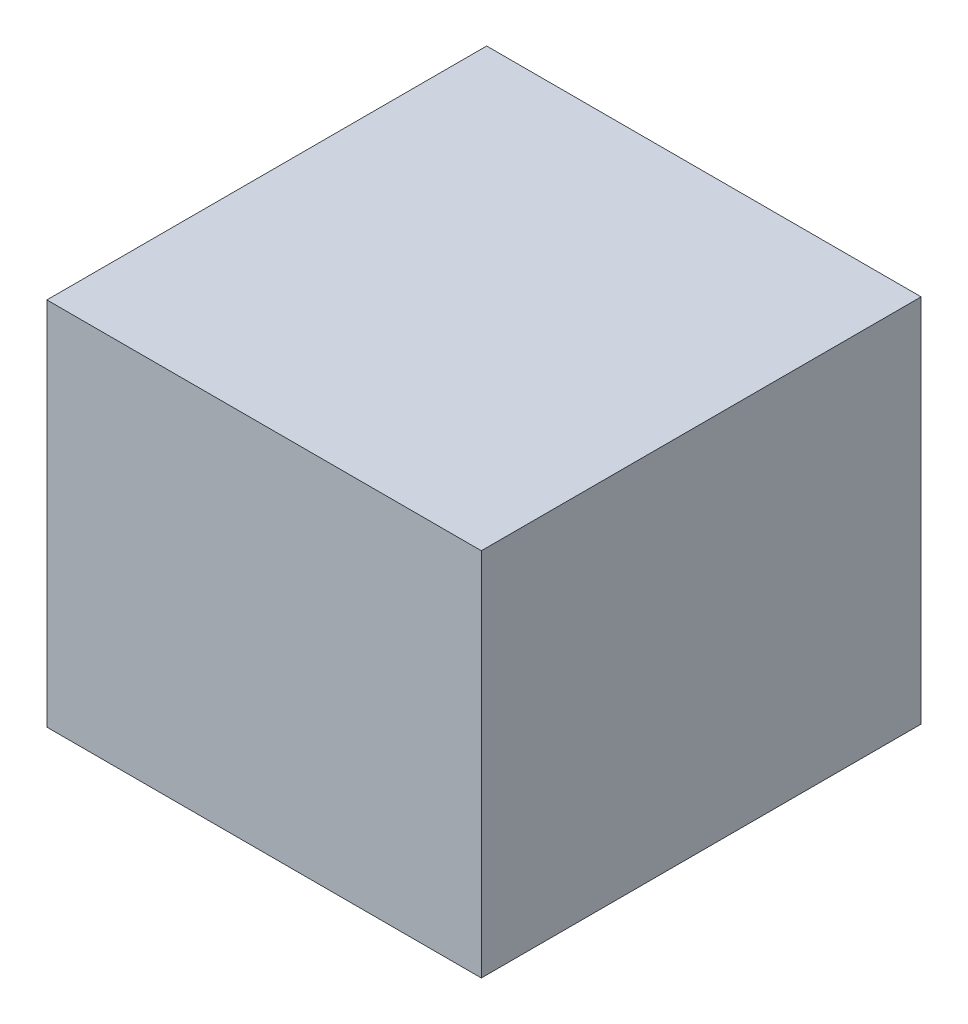
ISO-10303-21;
HEADER;
FILE_DESCRIPTION(('STEP AP214'),'2;1');
FILE_NAME('part.step','',(''),(''),'','','');
FILE_SCHEMA(('AUTOMOTIVE_DESIGN { 1 0 10303 214 1 1 1 1 }'));
ENDSEC;
DATA;
#1=APPLICATION_CONTEXT('core data for automotive mechanical design processes');
#2=APPLICATION_PROTOCOL_DEFINITION('international standard','automotive_design',2000,#1);
#3=PRODUCT_CONTEXT('',#1,'mechanical');
#4=PRODUCT('Part','Part','',(#3));
#5=PRODUCT_RELATED_PRODUCT_CATEGORY('part','',(#4));
#6=PRODUCT_DEFINITION_FORMATION('','',#4);
#7=PRODUCT_DEFINITION_CONTEXT('part definition',#1,'design');
#8=PRODUCT_DEFINITION('design','',#6,#7);
#9=PRODUCT_DEFINITION_SHAPE('','',#8);
#10=(LENGTH_UNIT() NAMED_UNIT(*) SI_UNIT(.MILLI.,.METRE.));
#11=(NAMED_UNIT(*) PLANE_ANGLE_UNIT() SI_UNIT($,.RADIAN.));
#12=(NAMED_UNIT(*) SI_UNIT($,.STERADIAN.) SOLID_ANGLE_UNIT());
#13=UNCERTAINTY_MEASURE_WITH_UNIT(LENGTH_MEASURE(1.E-05),#10,'distance_accuracy_value','');
#14=(GEOMETRIC_REPRESENTATION_CONTEXT(3) GLOBAL_UNCERTAINTY_ASSIGNED_CONTEXT((#13)) GLOBAL_UNIT_ASSIGNED_CONTEXT((#10,
#11,#12)) REPRESENTATION_CONTEXT('',''));
#15=CARTESIAN_POINT('',(0.,0.,0.));
#16=DIRECTION('',(0.,0.,1.));
#17=DIRECTION('',(1.,0.,0.));
#18=AXIS2_PLACEMENT_3D('',#15,#16,#17);
#19=CARTESIAN_POINT('',(0.,1.26999997064E-06,0.5999988));
#20=DIRECTION('',(0.,0.,-1.));
#21=DIRECTION('',(0.,-1.,0.));
#22=AXIS2_PLACEMENT_3D('',#19,#20,#21);
#23=PLANE('',#22);
#24=DIRECTION('',(0.999999999963275,8.57026550148136E-06,0.));
#25=VECTOR('',#24,1.);
#26=CARTESIAN_POINT('',(-0.29637482,0.25240742,0.5999988));
#27=LINE('',#26,#25);
#28=CARTESIAN_POINT('',(-0.29637482,0.25240742,0.5999988));
#29=VERTEX_POINT('',#28);
#30=CARTESIAN_POINT('',(0.29637228,0.2524125,0.5999988));
#31=VERTEX_POINT('',#30);
#32=EDGE_CURVE('E93',#29,#31,#27,.T.);
#33=ORIENTED_EDGE('',*,*,#32,.F.);
#34=DIRECTION('',(-5.03152242608172E-06,0.999999999987342,0.));
#35=VECTOR('',#34,1.);
#36=CARTESIAN_POINT('',(-0.29637228,-0.25240996,0.5999988));
#37=LINE('',#36,#35);
#38=CARTESIAN_POINT('',(-0.29637228,-0.25240996,0.5999988));
#39=VERTEX_POINT('',#38);
#40=EDGE_CURVE('E26',#39,#29,#37,.T.);
#41=ORIENTED_EDGE('',*,*,#40,.F.);
#42=DIRECTION('',(-0.999999999963275,-8.57026554942936E-06,0.));
#43=VECTOR('',#42,1.);
#44=CARTESIAN_POINT('',(0.29637482,-0.25240488,0.5999988));
#45=LINE('',#44,#43);
#46=CARTESIAN_POINT('',(0.29637482,-0.25240488,0.5999988));
#47=VERTEX_POINT('',#46);
#48=EDGE_CURVE('E82',#47,#39,#45,.T.);
#49=ORIENTED_EDGE('',*,*,#48,.F.);
#50=DIRECTION('',(5.03152253868372E-06,-0.999999999987342,0.));
#51=VECTOR('',#50,1.);
#52=CARTESIAN_POINT('',(0.29637228,0.2524125,0.5999988));
#53=LINE('',#52,#51);
#54=EDGE_CURVE('E90',#31,#47,#53,.T.);
#55=ORIENTED_EDGE('',*,*,#54,.F.);
#56=EDGE_LOOP('',(#33,#41,#49,#55));
#57=FACE_BOUND('',#56,.T.);
#58=ADVANCED_FACE('F16',(#57),#23,.F.);
#59=CARTESIAN_POINT('',(0.,1.26999997064E-06,0.));
#60=DIRECTION('',(0.,0.,-1.));
#61=DIRECTION('',(0.,-1.,0.));
#62=AXIS2_PLACEMENT_3D('',#59,#60,#61);
#63=PLANE('',#62);
#64=DIRECTION('',(0.999999999963275,8.57026550148136E-06,0.));
#65=VECTOR('',#64,1.);
#66=CARTESIAN_POINT('',(-0.29637482,0.25240742,0.));
#67=LINE('',#66,#65);
#68=CARTESIAN_POINT('',(-0.29637482,0.25240742,0.));
#69=VERTEX_POINT('',#68);
#70=CARTESIAN_POINT('',(0.29637228,0.2524125,0.));
#71=VERTEX_POINT('',#70);
#72=EDGE_CURVE('E85',#69,#71,#67,.T.);
#73=ORIENTED_EDGE('',*,*,#72,.T.);
#74=DIRECTION('',(5.03152253868372E-06,-0.999999999987342,0.));
#75=VECTOR('',#74,1.);
#76=CARTESIAN_POINT('',(0.29637228,0.2524125,0.));
#77=LINE('',#76,#75);
#78=CARTESIAN_POINT('',(0.29637482,-0.25240488,0.));
#79=VERTEX_POINT('',#78);
#80=EDGE_CURVE('E72',#71,#79,#77,.T.);
#81=ORIENTED_EDGE('',*,*,#80,.T.);
#82=DIRECTION('',(-0.999999999963275,-8.57026554942936E-06,0.));
#83=VECTOR('',#82,1.);
#84=CARTESIAN_POINT('',(0.29637482,-0.25240488,0.));
#85=LINE('',#84,#83);
#86=CARTESIAN_POINT('',(-0.29637228,-0.25240996,0.));
#87=VERTEX_POINT('',#86);
#88=EDGE_CURVE('E20',#79,#87,#85,.T.);
#89=ORIENTED_EDGE('',*,*,#88,.T.);
#90=DIRECTION('',(-5.03152242608172E-06,0.999999999987342,0.));
#91=VECTOR('',#90,1.);
#92=CARTESIAN_POINT('',(-0.29637228,-0.25240996,0.));
#93=LINE('',#92,#91);
#94=EDGE_CURVE('E11',#87,#69,#93,.T.);
#95=ORIENTED_EDGE('',*,*,#94,.T.);
#96=EDGE_LOOP('',(#73,#81,#89,#95));
#97=FACE_BOUND('',#96,.T.);
#98=ADVANCED_FACE('F86',(#97),#63,.T.);
#99=CARTESIAN_POINT('',(-0.29637228,-0.25240996,0.));
#100=DIRECTION('',(-0.999999999987342,-5.03152242608172E-06,0.));
#101=DIRECTION('',(-5.03152242608172E-06,0.999999999987342,0.));
#102=AXIS2_PLACEMENT_3D('',#99,#100,#101);
#103=PLANE('',#102);
#104=DIRECTION('',(0.,0.,1.));
#105=VECTOR('',#104,1.);
#106=CARTESIAN_POINT('',(-0.29637228,-0.25240996,0.));
#107=LINE('',#106,#105);
#108=EDGE_CURVE('E107',#87,#39,#107,.T.);
#109=ORIENTED_EDGE('',*,*,#108,.T.);
#110=ORIENTED_EDGE('',*,*,#40,.T.);
#111=DIRECTION('',(0.,0.,1.));
#112=VECTOR('',#111,1.);
#113=CARTESIAN_POINT('',(-0.29637482,0.25240742,0.));
#114=LINE('',#113,#112);
#115=EDGE_CURVE('E100',#69,#29,#114,.T.);
#116=ORIENTED_EDGE('',*,*,#115,.F.);
#117=ORIENTED_EDGE('',*,*,#94,.F.);
#118=EDGE_LOOP('',(#109,#110,#116,#117));
#119=FACE_BOUND('',#118,.T.);
#120=ADVANCED_FACE('F123',(#119),#103,.T.);
#121=CARTESIAN_POINT('',(0.29637482,-0.25240488,0.));
#122=DIRECTION('',(8.57026554942936E-06,-0.999999999963275,0.));
#123=DIRECTION('',(0.,0.,-1.));
#124=AXIS2_PLACEMENT_3D('',#121,#122,#123);
#125=PLANE('',#124);
#126=DIRECTION('',(0.,0.,1.));
#127=VECTOR('',#126,1.);
#128=CARTESIAN_POINT('',(0.29637482,-0.25240488,0.));
#129=LINE('',#128,#127);
#130=EDGE_CURVE('E79',#79,#47,#129,.T.);
#131=ORIENTED_EDGE('',*,*,#130,.T.);
#132=ORIENTED_EDGE('',*,*,#48,.T.);
#133=ORIENTED_EDGE('',*,*,#108,.F.);
#134=ORIENTED_EDGE('',*,*,#88,.F.);
#135=EDGE_LOOP('',(#131,#132,#133,#134));
#136=FACE_BOUND('',#135,.T.);
#137=ADVANCED_FACE('F122',(#136),#125,.T.);
#138=CARTESIAN_POINT('',(0.29637228,0.2524125,0.));
#139=DIRECTION('',(0.999999999987342,5.03152253868372E-06,0.));
#140=DIRECTION('',(0.,0.,-1.));
#141=AXIS2_PLACEMENT_3D('',#138,#139,#140);
#142=PLANE('',#141);
#143=DIRECTION('',(0.,0.,1.));
#144=VECTOR('',#143,1.);
#145=CARTESIAN_POINT('',(0.29637228,0.2524125,0.));
#146=LINE('',#145,#144);
#147=EDGE_CURVE('E76',#71,#31,#146,.T.);
#148=ORIENTED_EDGE('',*,*,#147,.T.);
#149=ORIENTED_EDGE('',*,*,#54,.T.);
#150=ORIENTED_EDGE('',*,*,#130,.F.);
#151=ORIENTED_EDGE('',*,*,#80,.F.);
#152=EDGE_LOOP('',(#148,#149,#150,#151));
#153=FACE_BOUND('',#152,.T.);
#154=ADVANCED_FACE('F18',(#153),#142,.T.);
#155=CARTESIAN_POINT('',(-0.29637482,0.25240742,0.));
#156=DIRECTION('',(-8.57026550148136E-06,0.999999999963275,0.));
#157=DIRECTION('',(0.,0.,1.));
#158=AXIS2_PLACEMENT_3D('',#155,#156,#157);
#159=PLANE('',#158);
#160=ORIENTED_EDGE('',*,*,#115,.T.);
#161=ORIENTED_EDGE('',*,*,#32,.T.);
#162=ORIENTED_EDGE('',*,*,#147,.F.);
#163=ORIENTED_EDGE('',*,*,#72,.F.);
#164=EDGE_LOOP('',(#160,#161,#162,#163));
#165=FACE_BOUND('',#164,.T.);
#166=ADVANCED_FACE('F92',(#165),#159,.T.);
#167=CLOSED_SHELL('',(#58,#98,#120,#137,#154,#166));
#168=MANIFOLD_SOLID_BREP('B1',#167);
#169=ADVANCED_BREP_SHAPE_REPRESENTATION('',(#18,#168),#14);
#170=SHAPE_DEFINITION_REPRESENTATION(#9,#169);
ENDSEC;
END-ISO-10303-21;
